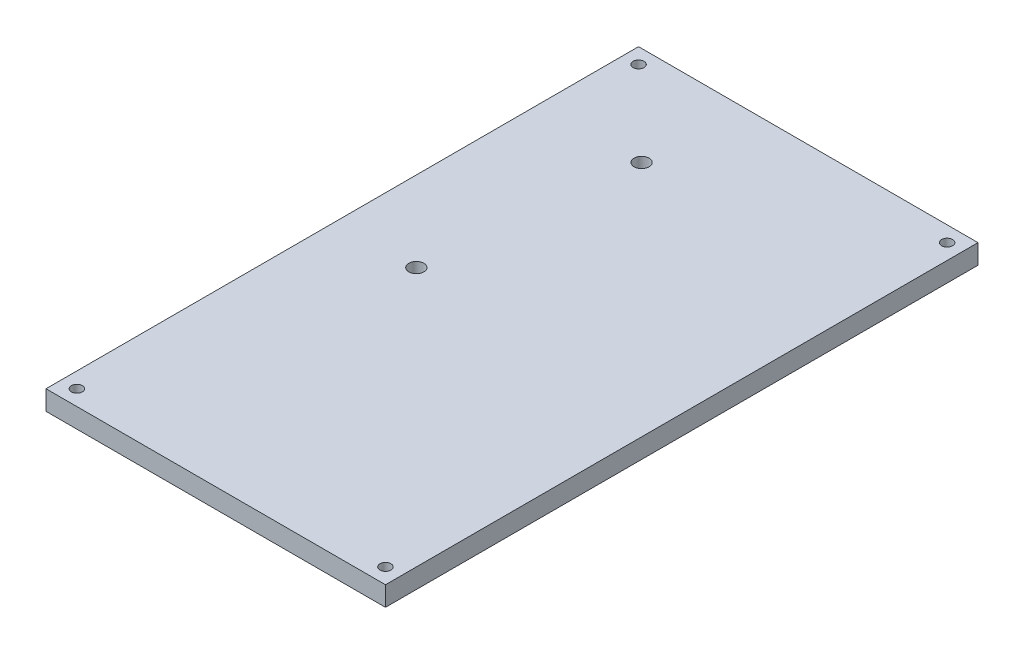
ISO-10303-21;
HEADER;
FILE_DESCRIPTION(('STEP AP214'),'2;1');
FILE_NAME('part.step','',(''),(''),'','','');
FILE_SCHEMA(('AUTOMOTIVE_DESIGN { 1 0 10303 214 1 1 1 1 }'));
ENDSEC;
DATA;
#1=APPLICATION_CONTEXT('core data for automotive mechanical design processes');
#2=APPLICATION_PROTOCOL_DEFINITION('international standard','automotive_design',2000,#1);
#3=PRODUCT_CONTEXT('',#1,'mechanical');
#4=PRODUCT('Part','Part','',(#3));
#5=PRODUCT_RELATED_PRODUCT_CATEGORY('part','',(#4));
#6=PRODUCT_DEFINITION_FORMATION('','',#4);
#7=PRODUCT_DEFINITION_CONTEXT('part definition',#1,'design');
#8=PRODUCT_DEFINITION('design','',#6,#7);
#9=PRODUCT_DEFINITION_SHAPE('','',#8);
#10=(LENGTH_UNIT() NAMED_UNIT(*) SI_UNIT(.MILLI.,.METRE.));
#11=(NAMED_UNIT(*) PLANE_ANGLE_UNIT() SI_UNIT($,.RADIAN.));
#12=(NAMED_UNIT(*) SI_UNIT($,.STERADIAN.) SOLID_ANGLE_UNIT());
#13=UNCERTAINTY_MEASURE_WITH_UNIT(LENGTH_MEASURE(1.E-05),#10,'distance_accuracy_value','');
#14=(GEOMETRIC_REPRESENTATION_CONTEXT(3) GLOBAL_UNCERTAINTY_ASSIGNED_CONTEXT((#13)) GLOBAL_UNIT_ASSIGNED_CONTEXT((#10,
#11,#12)) REPRESENTATION_CONTEXT('',''));
#15=CARTESIAN_POINT('',(0.,0.,0.));
#16=DIRECTION('',(0.,0.,1.));
#17=DIRECTION('',(1.,0.,0.));
#18=AXIS2_PLACEMENT_3D('',#15,#16,#17);
#19=CARTESIAN_POINT('',(0.,3.175,0.));
#20=DIRECTION('',(1.,0.,0.));
#21=DIRECTION('',(0.,0.,-1.));
#22=AXIS2_PLACEMENT_3D('',#19,#20,#21);
#23=PLANE('',#22);
#24=DIRECTION('',(0.,0.,1.));
#25=VECTOR('',#24,1.);
#26=CARTESIAN_POINT('',(0.,0.,0.));
#27=LINE('',#26,#25);
#28=CARTESIAN_POINT('',(0.,0.,-96.));
#29=VERTEX_POINT('',#28);
#30=CARTESIAN_POINT('',(0.,0.,0.));
#31=VERTEX_POINT('',#30);
#32=EDGE_CURVE('E111',#29,#31,#27,.T.);
#33=ORIENTED_EDGE('',*,*,#32,.T.);
#34=DIRECTION('',(0.,-1.,0.));
#35=VECTOR('',#34,1.);
#36=CARTESIAN_POINT('',(0.,3.175,0.));
#37=LINE('',#36,#35);
#38=CARTESIAN_POINT('',(0.,3.175,0.));
#39=VERTEX_POINT('',#38);
#40=EDGE_CURVE('E13',#39,#31,#37,.T.);
#41=ORIENTED_EDGE('',*,*,#40,.F.);
#42=DIRECTION('',(0.,0.,1.));
#43=VECTOR('',#42,1.);
#44=CARTESIAN_POINT('',(0.,3.175,0.));
#45=LINE('',#44,#43);
#46=CARTESIAN_POINT('',(0.,3.175,-96.));
#47=VERTEX_POINT('',#46);
#48=EDGE_CURVE('E99',#47,#39,#45,.T.);
#49=ORIENTED_EDGE('',*,*,#48,.F.);
#50=DIRECTION('',(0.,-1.,0.));
#51=VECTOR('',#50,1.);
#52=CARTESIAN_POINT('',(0.,3.175,-96.));
#53=LINE('',#52,#51);
#54=EDGE_CURVE('E107',#47,#29,#53,.T.);
#55=ORIENTED_EDGE('',*,*,#54,.T.);
#56=EDGE_LOOP('',(#33,#41,#49,#55));
#57=FACE_BOUND('',#56,.T.);
#58=ADVANCED_FACE('F48',(#57),#23,.F.);
#59=CARTESIAN_POINT('',(0.,3.175,0.));
#60=DIRECTION('',(0.,0.,-1.));
#61=DIRECTION('',(-1.,0.,0.));
#62=AXIS2_PLACEMENT_3D('',#59,#60,#61);
#63=PLANE('',#62);
#64=DIRECTION('',(1.,0.,0.));
#65=VECTOR('',#64,1.);
#66=CARTESIAN_POINT('',(0.,0.,0.));
#67=LINE('',#66,#65);
#68=CARTESIAN_POINT('',(55.,0.,0.));
#69=VERTEX_POINT('',#68);
#70=EDGE_CURVE('E103',#31,#69,#67,.T.);
#71=ORIENTED_EDGE('',*,*,#70,.T.);
#72=DIRECTION('',(0.,-1.,0.));
#73=VECTOR('',#72,1.);
#74=CARTESIAN_POINT('',(55.,3.175,0.));
#75=LINE('',#74,#73);
#76=CARTESIAN_POINT('',(55.,3.175,0.));
#77=VERTEX_POINT('',#76);
#78=EDGE_CURVE('E56',#77,#69,#75,.T.);
#79=ORIENTED_EDGE('',*,*,#78,.F.);
#80=DIRECTION('',(1.,0.,0.));
#81=VECTOR('',#80,1.);
#82=CARTESIAN_POINT('',(0.,3.175,0.));
#83=LINE('',#82,#81);
#84=EDGE_CURVE('E94',#39,#77,#83,.T.);
#85=ORIENTED_EDGE('',*,*,#84,.F.);
#86=ORIENTED_EDGE('',*,*,#40,.T.);
#87=EDGE_LOOP('',(#71,#79,#85,#86));
#88=FACE_BOUND('',#87,.T.);
#89=ADVANCED_FACE('F102',(#88),#63,.F.);
#90=CARTESIAN_POINT('',(55.,3.175,0.));
#91=DIRECTION('',(-1.,0.,0.));
#92=DIRECTION('',(0.,0.,1.));
#93=AXIS2_PLACEMENT_3D('',#90,#91,#92);
#94=PLANE('',#93);
#95=DIRECTION('',(0.,0.,-1.));
#96=VECTOR('',#95,1.);
#97=CARTESIAN_POINT('',(55.,0.,0.));
#98=LINE('',#97,#96);
#99=CARTESIAN_POINT('',(55.,0.,-96.));
#100=VERTEX_POINT('',#99);
#101=EDGE_CURVE('E81',#69,#100,#98,.T.);
#102=ORIENTED_EDGE('',*,*,#101,.T.);
#103=DIRECTION('',(0.,-1.,0.));
#104=VECTOR('',#103,1.);
#105=CARTESIAN_POINT('',(55.,3.175,-96.));
#106=LINE('',#105,#104);
#107=CARTESIAN_POINT('',(55.,3.175,-96.));
#108=VERTEX_POINT('',#107);
#109=EDGE_CURVE('E104',#108,#100,#106,.T.);
#110=ORIENTED_EDGE('',*,*,#109,.F.);
#111=DIRECTION('',(0.,0.,-1.));
#112=VECTOR('',#111,1.);
#113=CARTESIAN_POINT('',(55.,3.175,0.));
#114=LINE('',#113,#112);
#115=EDGE_CURVE('E97',#77,#108,#114,.T.);
#116=ORIENTED_EDGE('',*,*,#115,.F.);
#117=ORIENTED_EDGE('',*,*,#78,.T.);
#118=EDGE_LOOP('',(#102,#110,#116,#117));
#119=FACE_BOUND('',#118,.T.);
#120=ADVANCED_FACE('F105',(#119),#94,.F.);
#121=CARTESIAN_POINT('',(0.,3.175,-96.));
#122=DIRECTION('',(0.,0.,1.));
#123=DIRECTION('',(1.,0.,0.));
#124=AXIS2_PLACEMENT_3D('',#121,#122,#123);
#125=PLANE('',#124);
#126=DIRECTION('',(-1.,0.,0.));
#127=VECTOR('',#126,1.);
#128=CARTESIAN_POINT('',(0.,0.,-96.));
#129=LINE('',#128,#127);
#130=EDGE_CURVE('E87',#100,#29,#129,.T.);
#131=ORIENTED_EDGE('',*,*,#130,.T.);
#132=ORIENTED_EDGE('',*,*,#54,.F.);
#133=DIRECTION('',(-1.,0.,0.));
#134=VECTOR('',#133,1.);
#135=CARTESIAN_POINT('',(0.,3.175,-96.));
#136=LINE('',#135,#134);
#137=EDGE_CURVE('E64',#108,#47,#136,.T.);
#138=ORIENTED_EDGE('',*,*,#137,.F.);
#139=ORIENTED_EDGE('',*,*,#109,.T.);
#140=EDGE_LOOP('',(#131,#132,#138,#139));
#141=FACE_BOUND('',#140,.T.);
#142=ADVANCED_FACE('F119',(#141),#125,.F.);
#143=CARTESIAN_POINT('',(0.,3.175,0.));
#144=DIRECTION('',(0.,-1.,0.));
#145=DIRECTION('',(0.,0.,-1.));
#146=AXIS2_PLACEMENT_3D('',#143,#144,#145);
#147=PLANE('',#146);
#148=CARTESIAN_POINT('',(2.5,3.175,-2.5));
#149=DIRECTION('',(0.,1.,0.));
#150=DIRECTION('',(0.,0.,1.));
#151=AXIS2_PLACEMENT_3D('',#148,#149,#150);
#152=CIRCLE('',#151,0.889);
#153=CARTESIAN_POINT('',(2.5,3.175,-1.611));
#154=VERTEX_POINT('',#153);
#155=EDGE_CURVE('E157',#154,#154,#152,.T.);
#156=ORIENTED_EDGE('',*,*,#155,.F.);
#157=EDGE_LOOP('',(#156));
#158=FACE_BOUND('',#157,.T.);
#159=CARTESIAN_POINT('',(52.5,3.175,-2.5));
#160=DIRECTION('',(0.,1.,0.));
#161=DIRECTION('',(0.,0.,1.));
#162=AXIS2_PLACEMENT_3D('',#159,#160,#161);
#163=CIRCLE('',#162,0.889000000000001);
#164=CARTESIAN_POINT('',(52.5,3.175,-1.611));
#165=VERTEX_POINT('',#164);
#166=EDGE_CURVE('E151',#165,#165,#163,.T.);
#167=ORIENTED_EDGE('',*,*,#166,.F.);
#168=EDGE_LOOP('',(#167));
#169=FACE_BOUND('',#168,.T.);
#170=CARTESIAN_POINT('',(52.5,3.175,-93.5));
#171=DIRECTION('',(0.,1.,0.));
#172=DIRECTION('',(0.,0.,1.));
#173=AXIS2_PLACEMENT_3D('',#170,#171,#172);
#174=CIRCLE('',#173,0.889000000000001);
#175=CARTESIAN_POINT('',(52.5,3.175,-92.611));
#176=VERTEX_POINT('',#175);
#177=EDGE_CURVE('E145',#176,#176,#174,.T.);
#178=ORIENTED_EDGE('',*,*,#177,.F.);
#179=EDGE_LOOP('',(#178));
#180=FACE_BOUND('',#179,.T.);
#181=CARTESIAN_POINT('',(2.5,3.175,-93.5));
#182=DIRECTION('',(0.,1.,0.));
#183=DIRECTION('',(0.,0.,1.));
#184=AXIS2_PLACEMENT_3D('',#181,#182,#183);
#185=CIRCLE('',#184,0.889);
#186=CARTESIAN_POINT('',(2.5,3.175,-92.611));
#187=VERTEX_POINT('',#186);
#188=EDGE_CURVE('E139',#187,#187,#185,.T.);
#189=ORIENTED_EDGE('',*,*,#188,.F.);
#190=EDGE_LOOP('',(#189));
#191=FACE_BOUND('',#190,.T.);
#192=CARTESIAN_POINT('',(16.5,3.175,-80.));
#193=DIRECTION('',(0.,1.,0.));
#194=DIRECTION('',(0.,0.,1.));
#195=AXIS2_PLACEMENT_3D('',#192,#193,#194);
#196=CIRCLE('',#195,1.2192);
#197=CARTESIAN_POINT('',(16.5,3.175,-78.7808));
#198=VERTEX_POINT('',#197);
#199=EDGE_CURVE('E133',#198,#198,#196,.T.);
#200=ORIENTED_EDGE('',*,*,#199,.F.);
#201=EDGE_LOOP('',(#200));
#202=FACE_BOUND('',#201,.T.);
#203=CARTESIAN_POINT('',(13.,3.175,-47.));
#204=DIRECTION('',(0.,1.,0.));
#205=DIRECTION('',(0.,0.,1.));
#206=AXIS2_PLACEMENT_3D('',#203,#204,#205);
#207=CIRCLE('',#206,1.2192);
#208=CARTESIAN_POINT('',(13.,3.175,-45.7808));
#209=VERTEX_POINT('',#208);
#210=EDGE_CURVE('E127',#209,#209,#207,.T.);
#211=ORIENTED_EDGE('',*,*,#210,.F.);
#212=EDGE_LOOP('',(#211));
#213=FACE_BOUND('',#212,.T.);
#214=ORIENTED_EDGE('',*,*,#48,.T.);
#215=ORIENTED_EDGE('',*,*,#84,.T.);
#216=ORIENTED_EDGE('',*,*,#115,.T.);
#217=ORIENTED_EDGE('',*,*,#137,.T.);
#218=EDGE_LOOP('',(#214,#215,#216,#217));
#219=FACE_BOUND('',#218,.T.);
#220=ADVANCED_FACE('F95',(#158,#169,#180,#191,#202,#213,#219),#147,.F.);
#221=CARTESIAN_POINT('',(0.,0.,0.));
#222=DIRECTION('',(0.,-1.,0.));
#223=DIRECTION('',(0.,0.,-1.));
#224=AXIS2_PLACEMENT_3D('',#221,#222,#223);
#225=PLANE('',#224);
#226=CARTESIAN_POINT('',(2.5,0.,-2.5));
#227=DIRECTION('',(0.,1.,0.));
#228=DIRECTION('',(0.,0.,1.));
#229=AXIS2_PLACEMENT_3D('',#226,#227,#228);
#230=CIRCLE('',#229,0.889);
#231=CARTESIAN_POINT('',(2.5,0.,-1.611));
#232=VERTEX_POINT('',#231);
#233=EDGE_CURVE('E154',#232,#232,#230,.T.);
#234=ORIENTED_EDGE('',*,*,#233,.T.);
#235=EDGE_LOOP('',(#234));
#236=FACE_BOUND('',#235,.T.);
#237=CARTESIAN_POINT('',(52.5,0.,-2.5));
#238=DIRECTION('',(0.,1.,0.));
#239=DIRECTION('',(0.,0.,1.));
#240=AXIS2_PLACEMENT_3D('',#237,#238,#239);
#241=CIRCLE('',#240,0.889000000000001);
#242=CARTESIAN_POINT('',(52.5,0.,-1.611));
#243=VERTEX_POINT('',#242);
#244=EDGE_CURVE('E148',#243,#243,#241,.T.);
#245=ORIENTED_EDGE('',*,*,#244,.T.);
#246=EDGE_LOOP('',(#245));
#247=FACE_BOUND('',#246,.T.);
#248=CARTESIAN_POINT('',(52.5,0.,-93.5));
#249=DIRECTION('',(0.,1.,0.));
#250=DIRECTION('',(0.,0.,1.));
#251=AXIS2_PLACEMENT_3D('',#248,#249,#250);
#252=CIRCLE('',#251,0.889000000000001);
#253=CARTESIAN_POINT('',(52.5,0.,-92.611));
#254=VERTEX_POINT('',#253);
#255=EDGE_CURVE('E142',#254,#254,#252,.T.);
#256=ORIENTED_EDGE('',*,*,#255,.T.);
#257=EDGE_LOOP('',(#256));
#258=FACE_BOUND('',#257,.T.);
#259=CARTESIAN_POINT('',(2.5,0.,-93.5));
#260=DIRECTION('',(0.,1.,0.));
#261=DIRECTION('',(0.,0.,1.));
#262=AXIS2_PLACEMENT_3D('',#259,#260,#261);
#263=CIRCLE('',#262,0.889);
#264=CARTESIAN_POINT('',(2.5,0.,-92.611));
#265=VERTEX_POINT('',#264);
#266=EDGE_CURVE('E136',#265,#265,#263,.T.);
#267=ORIENTED_EDGE('',*,*,#266,.T.);
#268=EDGE_LOOP('',(#267));
#269=FACE_BOUND('',#268,.T.);
#270=CARTESIAN_POINT('',(16.5,0.,-80.));
#271=DIRECTION('',(0.,1.,0.));
#272=DIRECTION('',(0.,0.,1.));
#273=AXIS2_PLACEMENT_3D('',#270,#271,#272);
#274=CIRCLE('',#273,1.2192);
#275=CARTESIAN_POINT('',(16.5,0.,-78.7808));
#276=VERTEX_POINT('',#275);
#277=EDGE_CURVE('E130',#276,#276,#274,.T.);
#278=ORIENTED_EDGE('',*,*,#277,.T.);
#279=EDGE_LOOP('',(#278));
#280=FACE_BOUND('',#279,.T.);
#281=CARTESIAN_POINT('',(13.,0.,-47.));
#282=DIRECTION('',(0.,1.,0.));
#283=DIRECTION('',(0.,0.,1.));
#284=AXIS2_PLACEMENT_3D('',#281,#282,#283);
#285=CIRCLE('',#284,1.2192);
#286=CARTESIAN_POINT('',(13.,0.,-45.7808));
#287=VERTEX_POINT('',#286);
#288=EDGE_CURVE('E114',#287,#287,#285,.T.);
#289=ORIENTED_EDGE('',*,*,#288,.T.);
#290=EDGE_LOOP('',(#289));
#291=FACE_BOUND('',#290,.T.);
#292=ORIENTED_EDGE('',*,*,#32,.F.);
#293=ORIENTED_EDGE('',*,*,#130,.F.);
#294=ORIENTED_EDGE('',*,*,#101,.F.);
#295=ORIENTED_EDGE('',*,*,#70,.F.);
#296=EDGE_LOOP('',(#292,#293,#294,#295));
#297=FACE_BOUND('',#296,.T.);
#298=ADVANCED_FACE('F122',(#236,#247,#258,#269,#280,#291,#297),#225,.T.);
#299=CARTESIAN_POINT('',(13.,3.175,-47.));
#300=DIRECTION('',(0.,1.,0.));
#301=DIRECTION('',(0.,0.,1.));
#302=AXIS2_PLACEMENT_3D('',#299,#300,#301);
#303=CYLINDRICAL_SURFACE('',#302,1.2192);
#304=ORIENTED_EDGE('',*,*,#288,.F.);
#305=EDGE_LOOP('',(#304));
#306=FACE_BOUND('',#305,.T.);
#307=ORIENTED_EDGE('',*,*,#210,.T.);
#308=EDGE_LOOP('',(#307));
#309=FACE_BOUND('',#308,.T.);
#310=ADVANCED_FACE('F176',(#306,#309),#303,.F.);
#311=CARTESIAN_POINT('',(16.5,3.175,-80.));
#312=DIRECTION('',(0.,1.,0.));
#313=DIRECTION('',(0.,0.,1.));
#314=AXIS2_PLACEMENT_3D('',#311,#312,#313);
#315=CYLINDRICAL_SURFACE('',#314,1.2192);
#316=ORIENTED_EDGE('',*,*,#277,.F.);
#317=EDGE_LOOP('',(#316));
#318=FACE_BOUND('',#317,.T.);
#319=ORIENTED_EDGE('',*,*,#199,.T.);
#320=EDGE_LOOP('',(#319));
#321=FACE_BOUND('',#320,.T.);
#322=ADVANCED_FACE('F178',(#318,#321),#315,.F.);
#323=CARTESIAN_POINT('',(2.5,3.175,-93.5));
#324=DIRECTION('',(0.,1.,0.));
#325=DIRECTION('',(0.,0.,1.));
#326=AXIS2_PLACEMENT_3D('',#323,#324,#325);
#327=CYLINDRICAL_SURFACE('',#326,0.889);
#328=ORIENTED_EDGE('',*,*,#266,.F.);
#329=EDGE_LOOP('',(#328));
#330=FACE_BOUND('',#329,.T.);
#331=ORIENTED_EDGE('',*,*,#188,.T.);
#332=EDGE_LOOP('',(#331));
#333=FACE_BOUND('',#332,.T.);
#334=ADVANCED_FACE('F185',(#330,#333),#327,.F.);
#335=CARTESIAN_POINT('',(52.5,3.175,-93.5));
#336=DIRECTION('',(0.,1.,0.));
#337=DIRECTION('',(0.,0.,1.));
#338=AXIS2_PLACEMENT_3D('',#335,#336,#337);
#339=CYLINDRICAL_SURFACE('',#338,0.889000000000001);
#340=ORIENTED_EDGE('',*,*,#255,.F.);
#341=EDGE_LOOP('',(#340));
#342=FACE_BOUND('',#341,.T.);
#343=ORIENTED_EDGE('',*,*,#177,.T.);
#344=EDGE_LOOP('',(#343));
#345=FACE_BOUND('',#344,.T.);
#346=ADVANCED_FACE('F224',(#342,#345),#339,.F.);
#347=CARTESIAN_POINT('',(52.5,3.175,-2.5));
#348=DIRECTION('',(0.,1.,0.));
#349=DIRECTION('',(0.,0.,1.));
#350=AXIS2_PLACEMENT_3D('',#347,#348,#349);
#351=CYLINDRICAL_SURFACE('',#350,0.889000000000001);
#352=ORIENTED_EDGE('',*,*,#244,.F.);
#353=EDGE_LOOP('',(#352));
#354=FACE_BOUND('',#353,.T.);
#355=ORIENTED_EDGE('',*,*,#166,.T.);
#356=EDGE_LOOP('',(#355));
#357=FACE_BOUND('',#356,.T.);
#358=ADVANCED_FACE('F235',(#354,#357),#351,.F.);
#359=CARTESIAN_POINT('',(2.5,3.175,-2.5));
#360=DIRECTION('',(0.,1.,0.));
#361=DIRECTION('',(0.,0.,1.));
#362=AXIS2_PLACEMENT_3D('',#359,#360,#361);
#363=CYLINDRICAL_SURFACE('',#362,0.889);
#364=ORIENTED_EDGE('',*,*,#233,.F.);
#365=EDGE_LOOP('',(#364));
#366=FACE_BOUND('',#365,.T.);
#367=ORIENTED_EDGE('',*,*,#155,.T.);
#368=EDGE_LOOP('',(#367));
#369=FACE_BOUND('',#368,.T.);
#370=ADVANCED_FACE('F161',(#366,#369),#363,.F.);
#371=CLOSED_SHELL('',(#58,#89,#120,#142,#220,#298,#310,#322,#334,#346,#358,#370));
#372=MANIFOLD_SOLID_BREP('B2',#371);
#373=ADVANCED_BREP_SHAPE_REPRESENTATION('',(#18,#372),#14);
#374=SHAPE_DEFINITION_REPRESENTATION(#9,#373);
ENDSEC;
END-ISO-10303-21;
